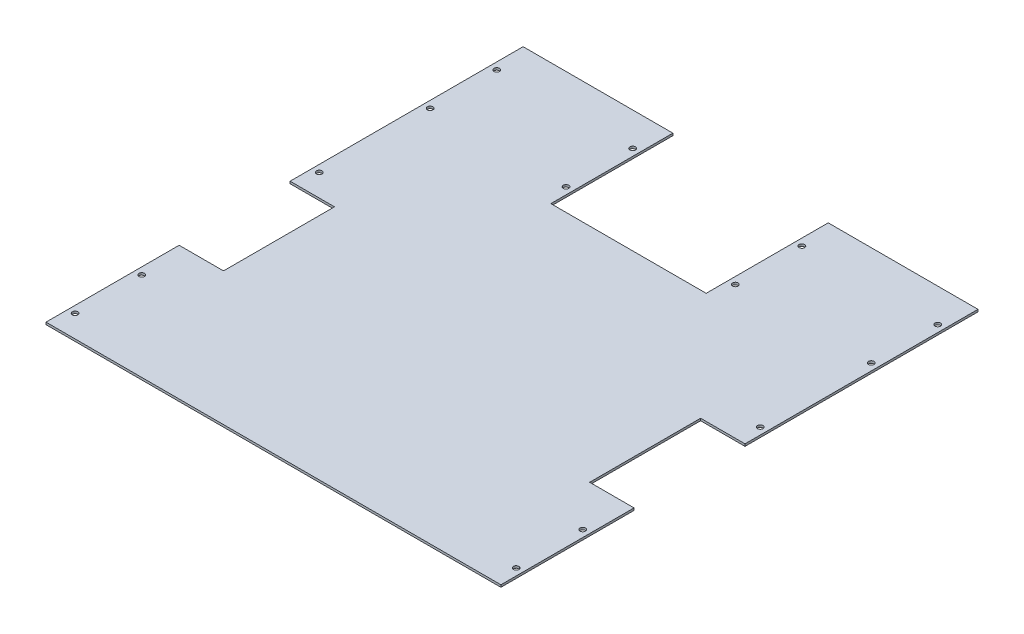
ISO-10303-21;
HEADER;
FILE_DESCRIPTION(('STEP AP214'),'2;1');
FILE_NAME('part.step','',(''),(''),'','','');
FILE_SCHEMA(('AUTOMOTIVE_DESIGN { 1 0 10303 214 1 1 1 1 }'));
ENDSEC;
DATA;
#1=APPLICATION_CONTEXT('core data for automotive mechanical design processes');
#2=APPLICATION_PROTOCOL_DEFINITION('international standard','automotive_design',2000,#1);
#3=PRODUCT_CONTEXT('',#1,'mechanical');
#4=PRODUCT('Part','Part','',(#3));
#5=PRODUCT_RELATED_PRODUCT_CATEGORY('part','',(#4));
#6=PRODUCT_DEFINITION_FORMATION('','',#4);
#7=PRODUCT_DEFINITION_CONTEXT('part definition',#1,'design');
#8=PRODUCT_DEFINITION('design','',#6,#7);
#9=PRODUCT_DEFINITION_SHAPE('','',#8);
#10=(LENGTH_UNIT() NAMED_UNIT(*) SI_UNIT(.MILLI.,.METRE.));
#11=(NAMED_UNIT(*) PLANE_ANGLE_UNIT() SI_UNIT($,.RADIAN.));
#12=(NAMED_UNIT(*) SI_UNIT($,.STERADIAN.) SOLID_ANGLE_UNIT());
#13=UNCERTAINTY_MEASURE_WITH_UNIT(LENGTH_MEASURE(1.E-05),#10,'distance_accuracy_value','');
#14=(GEOMETRIC_REPRESENTATION_CONTEXT(3) GLOBAL_UNCERTAINTY_ASSIGNED_CONTEXT((#13)) GLOBAL_UNIT_ASSIGNED_CONTEXT((#10,
#11,#12)) REPRESENTATION_CONTEXT('',''));
#15=CARTESIAN_POINT('',(0.,0.,0.));
#16=DIRECTION('',(0.,0.,1.));
#17=DIRECTION('',(1.,0.,0.));
#18=AXIS2_PLACEMENT_3D('',#15,#16,#17);
#19=CARTESIAN_POINT('',(0.,2.54,0.));
#20=DIRECTION('',(1.,0.,0.));
#21=DIRECTION('',(0.,0.,-1.));
#22=AXIS2_PLACEMENT_3D('',#19,#20,#21);
#23=PLANE('',#22);
#24=DIRECTION('',(0.,0.,1.));
#25=VECTOR('',#24,1.);
#26=CARTESIAN_POINT('',(0.,0.,0.));
#27=LINE('',#26,#25);
#28=CARTESIAN_POINT('',(0.,0.,-152.4));
#29=VERTEX_POINT('',#28);
#30=CARTESIAN_POINT('',(0.,0.,0.));
#31=VERTEX_POINT('',#30);
#32=EDGE_CURVE('E188',#29,#31,#27,.T.);
#33=ORIENTED_EDGE('',*,*,#32,.T.);
#34=DIRECTION('',(0.,-1.,0.));
#35=VECTOR('',#34,1.);
#36=CARTESIAN_POINT('',(0.,2.54,0.));
#37=LINE('',#36,#35);
#38=CARTESIAN_POINT('',(0.,2.54,0.));
#39=VERTEX_POINT('',#38);
#40=EDGE_CURVE('E11',#39,#31,#37,.T.);
#41=ORIENTED_EDGE('',*,*,#40,.F.);
#42=DIRECTION('',(0.,0.,1.));
#43=VECTOR('',#42,1.);
#44=CARTESIAN_POINT('',(0.,2.54,0.));
#45=LINE('',#44,#43);
#46=CARTESIAN_POINT('',(0.,2.54,-152.4));
#47=VERTEX_POINT('',#46);
#48=EDGE_CURVE('E235',#47,#39,#45,.T.);
#49=ORIENTED_EDGE('',*,*,#48,.F.);
#50=DIRECTION('',(0.,-1.,0.));
#51=VECTOR('',#50,1.);
#52=CARTESIAN_POINT('',(0.,2.54,-152.4));
#53=LINE('',#52,#51);
#54=EDGE_CURVE('E184',#47,#29,#53,.T.);
#55=ORIENTED_EDGE('',*,*,#54,.T.);
#56=EDGE_LOOP('',(#33,#41,#49,#55));
#57=FACE_BOUND('',#56,.T.);
#58=ADVANCED_FACE('F39',(#57),#23,.F.);
#59=CARTESIAN_POINT('',(0.,2.54,0.));
#60=DIRECTION('',(0.,0.,-1.));
#61=DIRECTION('',(-1.,0.,0.));
#62=AXIS2_PLACEMENT_3D('',#59,#60,#61);
#63=PLANE('',#62);
#64=DIRECTION('',(1.,0.,0.));
#65=VECTOR('',#64,1.);
#66=CARTESIAN_POINT('',(0.,0.,0.));
#67=LINE('',#66,#65);
#68=CARTESIAN_POINT('',(520.7,0.,0.));
#69=VERTEX_POINT('',#68);
#70=EDGE_CURVE('E192',#31,#69,#67,.T.);
#71=ORIENTED_EDGE('',*,*,#70,.T.);
#72=DIRECTION('',(0.,-1.,0.));
#73=VECTOR('',#72,1.);
#74=CARTESIAN_POINT('',(520.7,2.54,0.));
#75=LINE('',#74,#73);
#76=CARTESIAN_POINT('',(520.7,2.54,0.));
#77=VERTEX_POINT('',#76);
#78=EDGE_CURVE('E48',#77,#69,#75,.T.);
#79=ORIENTED_EDGE('',*,*,#78,.F.);
#80=DIRECTION('',(1.,0.,0.));
#81=VECTOR('',#80,1.);
#82=CARTESIAN_POINT('',(0.,2.54,0.));
#83=LINE('',#82,#81);
#84=EDGE_CURVE('E123',#39,#77,#83,.T.);
#85=ORIENTED_EDGE('',*,*,#84,.F.);
#86=ORIENTED_EDGE('',*,*,#40,.T.);
#87=EDGE_LOOP('',(#71,#79,#85,#86));
#88=FACE_BOUND('',#87,.T.);
#89=ADVANCED_FACE('F358',(#88),#63,.F.);
#90=CARTESIAN_POINT('',(520.7,2.54,0.));
#91=DIRECTION('',(-1.,0.,0.));
#92=DIRECTION('',(0.,0.,1.));
#93=AXIS2_PLACEMENT_3D('',#90,#91,#92);
#94=PLANE('',#93);
#95=DIRECTION('',(0.,0.,-1.));
#96=VECTOR('',#95,1.);
#97=CARTESIAN_POINT('',(520.7,0.,0.));
#98=LINE('',#97,#96);
#99=CARTESIAN_POINT('',(520.7,0.,-152.4));
#100=VERTEX_POINT('',#99);
#101=EDGE_CURVE('E196',#69,#100,#98,.T.);
#102=ORIENTED_EDGE('',*,*,#101,.T.);
#103=DIRECTION('',(0.,-1.,0.));
#104=VECTOR('',#103,1.);
#105=CARTESIAN_POINT('',(520.7,2.54,-152.4));
#106=LINE('',#105,#104);
#107=CARTESIAN_POINT('',(520.7,2.54,-152.4));
#108=VERTEX_POINT('',#107);
#109=EDGE_CURVE('E278',#108,#100,#106,.T.);
#110=ORIENTED_EDGE('',*,*,#109,.F.);
#111=DIRECTION('',(0.,0.,-1.));
#112=VECTOR('',#111,1.);
#113=CARTESIAN_POINT('',(520.7,2.54,0.));
#114=LINE('',#113,#112);
#115=EDGE_CURVE('E288',#77,#108,#114,.T.);
#116=ORIENTED_EDGE('',*,*,#115,.F.);
#117=ORIENTED_EDGE('',*,*,#78,.T.);
#118=EDGE_LOOP('',(#102,#110,#116,#117));
#119=FACE_BOUND('',#118,.T.);
#120=ADVANCED_FACE('F286',(#119),#94,.F.);
#121=CARTESIAN_POINT('',(520.7,2.54,-152.4));
#122=DIRECTION('',(0.,0.,1.));
#123=DIRECTION('',(1.,0.,0.));
#124=AXIS2_PLACEMENT_3D('',#121,#122,#123);
#125=PLANE('',#124);
#126=DIRECTION('',(-1.,0.,0.));
#127=VECTOR('',#126,1.);
#128=CARTESIAN_POINT('',(520.7,0.,-152.4));
#129=LINE('',#128,#127);
#130=CARTESIAN_POINT('',(469.9,0.,-152.4));
#131=VERTEX_POINT('',#130);
#132=EDGE_CURVE('E199',#100,#131,#129,.T.);
#133=ORIENTED_EDGE('',*,*,#132,.T.);
#134=DIRECTION('',(0.,-1.,0.));
#135=VECTOR('',#134,1.);
#136=CARTESIAN_POINT('',(469.9,2.54,-152.4));
#137=LINE('',#136,#135);
#138=CARTESIAN_POINT('',(469.9,2.54,-152.4));
#139=VERTEX_POINT('',#138);
#140=EDGE_CURVE('E274',#139,#131,#137,.T.);
#141=ORIENTED_EDGE('',*,*,#140,.F.);
#142=DIRECTION('',(-1.,0.,0.));
#143=VECTOR('',#142,1.);
#144=CARTESIAN_POINT('',(520.7,2.54,-152.4));
#145=LINE('',#144,#143);
#146=EDGE_CURVE('E307',#108,#139,#145,.T.);
#147=ORIENTED_EDGE('',*,*,#146,.F.);
#148=ORIENTED_EDGE('',*,*,#109,.T.);
#149=EDGE_LOOP('',(#133,#141,#147,#148));
#150=FACE_BOUND('',#149,.T.);
#151=ADVANCED_FACE('F297',(#150),#125,.F.);
#152=CARTESIAN_POINT('',(469.9,2.54,-152.4));
#153=DIRECTION('',(-1.,0.,0.));
#154=DIRECTION('',(0.,0.,1.));
#155=AXIS2_PLACEMENT_3D('',#152,#153,#154);
#156=PLANE('',#155);
#157=DIRECTION('',(0.,0.,-1.));
#158=VECTOR('',#157,1.);
#159=CARTESIAN_POINT('',(469.9,0.,-152.4));
#160=LINE('',#159,#158);
#161=CARTESIAN_POINT('',(469.9,0.,-279.4));
#162=VERTEX_POINT('',#161);
#163=EDGE_CURVE('E202',#131,#162,#160,.T.);
#164=ORIENTED_EDGE('',*,*,#163,.T.);
#165=DIRECTION('',(0.,-1.,0.));
#166=VECTOR('',#165,1.);
#167=CARTESIAN_POINT('',(469.9,2.54,-279.4));
#168=LINE('',#167,#166);
#169=CARTESIAN_POINT('',(469.9,2.54,-279.4));
#170=VERTEX_POINT('',#169);
#171=EDGE_CURVE('E270',#170,#162,#168,.T.);
#172=ORIENTED_EDGE('',*,*,#171,.F.);
#173=DIRECTION('',(0.,0.,-1.));
#174=VECTOR('',#173,1.);
#175=CARTESIAN_POINT('',(469.9,2.54,-152.4));
#176=LINE('',#175,#174);
#177=EDGE_CURVE('E303',#139,#170,#176,.T.);
#178=ORIENTED_EDGE('',*,*,#177,.F.);
#179=ORIENTED_EDGE('',*,*,#140,.T.);
#180=EDGE_LOOP('',(#164,#172,#178,#179));
#181=FACE_BOUND('',#180,.T.);
#182=ADVANCED_FACE('F301',(#181),#156,.F.);
#183=CARTESIAN_POINT('',(520.7,2.54,-279.4));
#184=DIRECTION('',(0.,0.,-1.));
#185=DIRECTION('',(-1.,0.,0.));
#186=AXIS2_PLACEMENT_3D('',#183,#184,#185);
#187=PLANE('',#186);
#188=DIRECTION('',(1.,0.,0.));
#189=VECTOR('',#188,1.);
#190=CARTESIAN_POINT('',(520.7,0.,-279.4));
#191=LINE('',#190,#189);
#192=CARTESIAN_POINT('',(520.7,0.,-279.4));
#193=VERTEX_POINT('',#192);
#194=EDGE_CURVE('E205',#162,#193,#191,.T.);
#195=ORIENTED_EDGE('',*,*,#194,.T.);
#196=DIRECTION('',(0.,-1.,0.));
#197=VECTOR('',#196,1.);
#198=CARTESIAN_POINT('',(520.7,2.54,-279.4));
#199=LINE('',#198,#197);
#200=CARTESIAN_POINT('',(520.7,2.54,-279.4));
#201=VERTEX_POINT('',#200);
#202=EDGE_CURVE('E266',#201,#193,#199,.T.);
#203=ORIENTED_EDGE('',*,*,#202,.F.);
#204=DIRECTION('',(1.,0.,0.));
#205=VECTOR('',#204,1.);
#206=CARTESIAN_POINT('',(520.7,2.54,-279.4));
#207=LINE('',#206,#205);
#208=EDGE_CURVE('E306',#170,#201,#207,.T.);
#209=ORIENTED_EDGE('',*,*,#208,.F.);
#210=ORIENTED_EDGE('',*,*,#171,.T.);
#211=EDGE_LOOP('',(#195,#203,#209,#210));
#212=FACE_BOUND('',#211,.T.);
#213=ADVANCED_FACE('F371',(#212),#187,.F.);
#214=CARTESIAN_POINT('',(520.7,2.54,-279.4));
#215=DIRECTION('',(-1.,0.,0.));
#216=DIRECTION('',(0.,0.,1.));
#217=AXIS2_PLACEMENT_3D('',#214,#215,#216);
#218=PLANE('',#217);
#219=DIRECTION('',(0.,0.,-1.));
#220=VECTOR('',#219,1.);
#221=CARTESIAN_POINT('',(520.7,0.,-279.4));
#222=LINE('',#221,#220);
#223=CARTESIAN_POINT('',(520.7,0.,-546.1));
#224=VERTEX_POINT('',#223);
#225=EDGE_CURVE('E208',#193,#224,#222,.T.);
#226=ORIENTED_EDGE('',*,*,#225,.T.);
#227=DIRECTION('',(0.,-1.,0.));
#228=VECTOR('',#227,1.);
#229=CARTESIAN_POINT('',(520.7,2.54,-546.1));
#230=LINE('',#229,#228);
#231=CARTESIAN_POINT('',(520.7,2.54,-546.1));
#232=VERTEX_POINT('',#231);
#233=EDGE_CURVE('E262',#232,#224,#230,.T.);
#234=ORIENTED_EDGE('',*,*,#233,.F.);
#235=DIRECTION('',(0.,0.,-1.));
#236=VECTOR('',#235,1.);
#237=CARTESIAN_POINT('',(520.7,2.54,-279.4));
#238=LINE('',#237,#236);
#239=EDGE_CURVE('E311',#201,#232,#238,.T.);
#240=ORIENTED_EDGE('',*,*,#239,.F.);
#241=ORIENTED_EDGE('',*,*,#202,.T.);
#242=EDGE_LOOP('',(#226,#234,#240,#241));
#243=FACE_BOUND('',#242,.T.);
#244=ADVANCED_FACE('F374',(#243),#218,.F.);
#245=CARTESIAN_POINT('',(349.25,2.54,-546.1));
#246=DIRECTION('',(0.,0.,1.));
#247=DIRECTION('',(1.,0.,0.));
#248=AXIS2_PLACEMENT_3D('',#245,#246,#247);
#249=PLANE('',#248);
#250=DIRECTION('',(-1.,0.,0.));
#251=VECTOR('',#250,1.);
#252=CARTESIAN_POINT('',(349.25,0.,-546.1));
#253=LINE('',#252,#251);
#254=CARTESIAN_POINT('',(349.25,0.,-546.1));
#255=VERTEX_POINT('',#254);
#256=EDGE_CURVE('E211',#224,#255,#253,.T.);
#257=ORIENTED_EDGE('',*,*,#256,.T.);
#258=DIRECTION('',(0.,-1.,0.));
#259=VECTOR('',#258,1.);
#260=CARTESIAN_POINT('',(349.25,2.54,-546.1));
#261=LINE('',#260,#259);
#262=CARTESIAN_POINT('',(349.25,2.54,-546.1));
#263=VERTEX_POINT('',#262);
#264=EDGE_CURVE('E258',#263,#255,#261,.T.);
#265=ORIENTED_EDGE('',*,*,#264,.F.);
#266=DIRECTION('',(-1.,0.,0.));
#267=VECTOR('',#266,1.);
#268=CARTESIAN_POINT('',(349.25,2.54,-546.1));
#269=LINE('',#268,#267);
#270=EDGE_CURVE('E318',#232,#263,#269,.T.);
#271=ORIENTED_EDGE('',*,*,#270,.F.);
#272=ORIENTED_EDGE('',*,*,#233,.T.);
#273=EDGE_LOOP('',(#257,#265,#271,#272));
#274=FACE_BOUND('',#273,.T.);
#275=ADVANCED_FACE('F378',(#274),#249,.F.);
#276=CARTESIAN_POINT('',(349.25,2.54,-546.1));
#277=DIRECTION('',(1.,0.,0.));
#278=DIRECTION('',(0.,0.,-1.));
#279=AXIS2_PLACEMENT_3D('',#276,#277,#278);
#280=PLANE('',#279);
#281=DIRECTION('',(0.,0.,1.));
#282=VECTOR('',#281,1.);
#283=CARTESIAN_POINT('',(349.25,0.,-546.1));
#284=LINE('',#283,#282);
#285=CARTESIAN_POINT('',(349.25,0.,-406.4));
#286=VERTEX_POINT('',#285);
#287=EDGE_CURVE('E214',#255,#286,#284,.T.);
#288=ORIENTED_EDGE('',*,*,#287,.T.);
#289=DIRECTION('',(0.,-1.,0.));
#290=VECTOR('',#289,1.);
#291=CARTESIAN_POINT('',(349.25,2.54,-406.4));
#292=LINE('',#291,#290);
#293=CARTESIAN_POINT('',(349.25,2.54,-406.4));
#294=VERTEX_POINT('',#293);
#295=EDGE_CURVE('E254',#294,#286,#292,.T.);
#296=ORIENTED_EDGE('',*,*,#295,.F.);
#297=DIRECTION('',(0.,0.,1.));
#298=VECTOR('',#297,1.);
#299=CARTESIAN_POINT('',(349.25,2.54,-546.1));
#300=LINE('',#299,#298);
#301=EDGE_CURVE('E321',#263,#294,#300,.T.);
#302=ORIENTED_EDGE('',*,*,#301,.F.);
#303=ORIENTED_EDGE('',*,*,#264,.T.);
#304=EDGE_LOOP('',(#288,#296,#302,#303));
#305=FACE_BOUND('',#304,.T.);
#306=ADVANCED_FACE('F382',(#305),#280,.F.);
#307=CARTESIAN_POINT('',(171.45,2.54,-406.4));
#308=DIRECTION('',(0.,0.,1.));
#309=DIRECTION('',(1.,0.,0.));
#310=AXIS2_PLACEMENT_3D('',#307,#308,#309);
#311=PLANE('',#310);
#312=DIRECTION('',(-1.,0.,0.));
#313=VECTOR('',#312,1.);
#314=CARTESIAN_POINT('',(171.45,0.,-406.4));
#315=LINE('',#314,#313);
#316=CARTESIAN_POINT('',(171.45,0.,-406.4));
#317=VERTEX_POINT('',#316);
#318=EDGE_CURVE('E217',#286,#317,#315,.T.);
#319=ORIENTED_EDGE('',*,*,#318,.T.);
#320=DIRECTION('',(0.,-1.,0.));
#321=VECTOR('',#320,1.);
#322=CARTESIAN_POINT('',(171.45,2.54,-406.4));
#323=LINE('',#322,#321);
#324=CARTESIAN_POINT('',(171.45,2.54,-406.4));
#325=VERTEX_POINT('',#324);
#326=EDGE_CURVE('E250',#325,#317,#323,.T.);
#327=ORIENTED_EDGE('',*,*,#326,.F.);
#328=DIRECTION('',(-1.,0.,0.));
#329=VECTOR('',#328,1.);
#330=CARTESIAN_POINT('',(171.45,2.54,-406.4));
#331=LINE('',#330,#329);
#332=EDGE_CURVE('E324',#294,#325,#331,.T.);
#333=ORIENTED_EDGE('',*,*,#332,.F.);
#334=ORIENTED_EDGE('',*,*,#295,.T.);
#335=EDGE_LOOP('',(#319,#327,#333,#334));
#336=FACE_BOUND('',#335,.T.);
#337=ADVANCED_FACE('F386',(#336),#311,.F.);
#338=CARTESIAN_POINT('',(171.45,2.54,-546.1));
#339=DIRECTION('',(-1.,0.,0.));
#340=DIRECTION('',(0.,0.,1.));
#341=AXIS2_PLACEMENT_3D('',#338,#339,#340);
#342=PLANE('',#341);
#343=DIRECTION('',(0.,0.,-1.));
#344=VECTOR('',#343,1.);
#345=CARTESIAN_POINT('',(171.45,0.,-546.1));
#346=LINE('',#345,#344);
#347=CARTESIAN_POINT('',(171.45,0.,-546.1));
#348=VERTEX_POINT('',#347);
#349=EDGE_CURVE('E220',#317,#348,#346,.T.);
#350=ORIENTED_EDGE('',*,*,#349,.T.);
#351=DIRECTION('',(0.,-1.,0.));
#352=VECTOR('',#351,1.);
#353=CARTESIAN_POINT('',(171.45,2.54,-546.1));
#354=LINE('',#353,#352);
#355=CARTESIAN_POINT('',(171.45,2.54,-546.1));
#356=VERTEX_POINT('',#355);
#357=EDGE_CURVE('E246',#356,#348,#354,.T.);
#358=ORIENTED_EDGE('',*,*,#357,.F.);
#359=DIRECTION('',(0.,0.,-1.));
#360=VECTOR('',#359,1.);
#361=CARTESIAN_POINT('',(171.45,2.54,-546.1));
#362=LINE('',#361,#360);
#363=EDGE_CURVE('E327',#325,#356,#362,.T.);
#364=ORIENTED_EDGE('',*,*,#363,.F.);
#365=ORIENTED_EDGE('',*,*,#326,.T.);
#366=EDGE_LOOP('',(#350,#358,#364,#365));
#367=FACE_BOUND('',#366,.T.);
#368=ADVANCED_FACE('F390',(#367),#342,.F.);
#369=CARTESIAN_POINT('',(0.,2.54,-546.1));
#370=DIRECTION('',(0.,0.,1.));
#371=DIRECTION('',(1.,0.,0.));
#372=AXIS2_PLACEMENT_3D('',#369,#370,#371);
#373=PLANE('',#372);
#374=DIRECTION('',(-1.,0.,0.));
#375=VECTOR('',#374,1.);
#376=CARTESIAN_POINT('',(0.,0.,-546.1));
#377=LINE('',#376,#375);
#378=CARTESIAN_POINT('',(0.,0.,-546.1));
#379=VERTEX_POINT('',#378);
#380=EDGE_CURVE('E223',#348,#379,#377,.T.);
#381=ORIENTED_EDGE('',*,*,#380,.T.);
#382=DIRECTION('',(0.,-1.,0.));
#383=VECTOR('',#382,1.);
#384=CARTESIAN_POINT('',(0.,2.54,-546.1));
#385=LINE('',#384,#383);
#386=CARTESIAN_POINT('',(0.,2.54,-546.1));
#387=VERTEX_POINT('',#386);
#388=EDGE_CURVE('E242',#387,#379,#385,.T.);
#389=ORIENTED_EDGE('',*,*,#388,.F.);
#390=DIRECTION('',(-1.,0.,0.));
#391=VECTOR('',#390,1.);
#392=CARTESIAN_POINT('',(0.,2.54,-546.1));
#393=LINE('',#392,#391);
#394=EDGE_CURVE('E330',#356,#387,#393,.T.);
#395=ORIENTED_EDGE('',*,*,#394,.F.);
#396=ORIENTED_EDGE('',*,*,#357,.T.);
#397=EDGE_LOOP('',(#381,#389,#395,#396));
#398=FACE_BOUND('',#397,.T.);
#399=ADVANCED_FACE('F338',(#398),#373,.F.);
#400=CARTESIAN_POINT('',(0.,2.54,-279.4));
#401=DIRECTION('',(1.,0.,0.));
#402=DIRECTION('',(0.,0.,-1.));
#403=AXIS2_PLACEMENT_3D('',#400,#401,#402);
#404=PLANE('',#403);
#405=DIRECTION('',(0.,0.,1.));
#406=VECTOR('',#405,1.);
#407=CARTESIAN_POINT('',(0.,0.,-279.4));
#408=LINE('',#407,#406);
#409=CARTESIAN_POINT('',(0.,0.,-279.4));
#410=VERTEX_POINT('',#409);
#411=EDGE_CURVE('E226',#379,#410,#408,.T.);
#412=ORIENTED_EDGE('',*,*,#411,.T.);
#413=DIRECTION('',(0.,-1.,0.));
#414=VECTOR('',#413,1.);
#415=CARTESIAN_POINT('',(0.,2.54,-279.4));
#416=LINE('',#415,#414);
#417=CARTESIAN_POINT('',(0.,2.54,-279.4));
#418=VERTEX_POINT('',#417);
#419=EDGE_CURVE('E177',#418,#410,#416,.T.);
#420=ORIENTED_EDGE('',*,*,#419,.F.);
#421=DIRECTION('',(0.,0.,1.));
#422=VECTOR('',#421,1.);
#423=CARTESIAN_POINT('',(0.,2.54,-279.4));
#424=LINE('',#423,#422);
#425=EDGE_CURVE('E166',#387,#418,#424,.T.);
#426=ORIENTED_EDGE('',*,*,#425,.F.);
#427=ORIENTED_EDGE('',*,*,#388,.T.);
#428=EDGE_LOOP('',(#412,#420,#426,#427));
#429=FACE_BOUND('',#428,.T.);
#430=ADVANCED_FACE('F342',(#429),#404,.F.);
#431=CARTESIAN_POINT('',(0.,2.54,-279.4));
#432=DIRECTION('',(0.,0.,-1.));
#433=DIRECTION('',(-1.,0.,0.));
#434=AXIS2_PLACEMENT_3D('',#431,#432,#433);
#435=PLANE('',#434);
#436=DIRECTION('',(1.,0.,0.));
#437=VECTOR('',#436,1.);
#438=CARTESIAN_POINT('',(0.,0.,-279.4));
#439=LINE('',#438,#437);
#440=CARTESIAN_POINT('',(50.7999999999999,0.,-279.4));
#441=VERTEX_POINT('',#440);
#442=EDGE_CURVE('E175',#410,#441,#439,.T.);
#443=ORIENTED_EDGE('',*,*,#442,.T.);
#444=DIRECTION('',(0.,-1.,0.));
#445=VECTOR('',#444,1.);
#446=CARTESIAN_POINT('',(50.7999999999999,2.54,-279.4));
#447=LINE('',#446,#445);
#448=CARTESIAN_POINT('',(50.7999999999999,2.54,-279.4));
#449=VERTEX_POINT('',#448);
#450=EDGE_CURVE('E172',#449,#441,#447,.T.);
#451=ORIENTED_EDGE('',*,*,#450,.F.);
#452=DIRECTION('',(1.,0.,0.));
#453=VECTOR('',#452,1.);
#454=CARTESIAN_POINT('',(0.,2.54,-279.4));
#455=LINE('',#454,#453);
#456=EDGE_CURVE('E160',#418,#449,#455,.T.);
#457=ORIENTED_EDGE('',*,*,#456,.F.);
#458=ORIENTED_EDGE('',*,*,#419,.T.);
#459=EDGE_LOOP('',(#443,#451,#457,#458));
#460=FACE_BOUND('',#459,.T.);
#461=ADVANCED_FACE('F173',(#460),#435,.F.);
#462=CARTESIAN_POINT('',(50.8,2.54,-152.4));
#463=DIRECTION('',(1.,0.,0.));
#464=DIRECTION('',(0.,0.,-1.));
#465=AXIS2_PLACEMENT_3D('',#462,#463,#464);
#466=PLANE('',#465);
#467=DIRECTION('',(0.,0.,1.));
#468=VECTOR('',#467,1.);
#469=CARTESIAN_POINT('',(50.8,0.,-152.4));
#470=LINE('',#469,#468);
#471=CARTESIAN_POINT('',(50.8,0.,-152.4));
#472=VERTEX_POINT('',#471);
#473=EDGE_CURVE('E109',#441,#472,#470,.T.);
#474=ORIENTED_EDGE('',*,*,#473,.T.);
#475=DIRECTION('',(0.,-1.,0.));
#476=VECTOR('',#475,1.);
#477=CARTESIAN_POINT('',(50.8,2.54,-152.4));
#478=LINE('',#477,#476);
#479=CARTESIAN_POINT('',(50.8,2.54,-152.4));
#480=VERTEX_POINT('',#479);
#481=EDGE_CURVE('E178',#480,#472,#478,.T.);
#482=ORIENTED_EDGE('',*,*,#481,.F.);
#483=DIRECTION('',(0.,0.,1.));
#484=VECTOR('',#483,1.);
#485=CARTESIAN_POINT('',(50.8,2.54,-152.4));
#486=LINE('',#485,#484);
#487=EDGE_CURVE('E164',#449,#480,#486,.T.);
#488=ORIENTED_EDGE('',*,*,#487,.F.);
#489=ORIENTED_EDGE('',*,*,#450,.T.);
#490=EDGE_LOOP('',(#474,#482,#488,#489));
#491=FACE_BOUND('',#490,.T.);
#492=ADVANCED_FACE('F180',(#491),#466,.F.);
#493=CARTESIAN_POINT('',(0.,2.54,-152.4));
#494=DIRECTION('',(0.,0.,1.));
#495=DIRECTION('',(1.,0.,0.));
#496=AXIS2_PLACEMENT_3D('',#493,#494,#495);
#497=PLANE('',#496);
#498=DIRECTION('',(-1.,0.,0.));
#499=VECTOR('',#498,1.);
#500=CARTESIAN_POINT('',(0.,0.,-152.4));
#501=LINE('',#500,#499);
#502=EDGE_CURVE('E115',#472,#29,#501,.T.);
#503=ORIENTED_EDGE('',*,*,#502,.T.);
#504=ORIENTED_EDGE('',*,*,#54,.F.);
#505=DIRECTION('',(-1.,0.,0.));
#506=VECTOR('',#505,1.);
#507=CARTESIAN_POINT('',(0.,2.54,-152.4));
#508=LINE('',#507,#506);
#509=EDGE_CURVE('E56',#480,#47,#508,.T.);
#510=ORIENTED_EDGE('',*,*,#509,.F.);
#511=ORIENTED_EDGE('',*,*,#481,.T.);
#512=EDGE_LOOP('',(#503,#504,#510,#511));
#513=FACE_BOUND('',#512,.T.);
#514=ADVANCED_FACE('F346',(#513),#497,.F.);
#515=CARTESIAN_POINT('',(0.,2.54,0.));
#516=DIRECTION('',(0.,-1.,0.));
#517=DIRECTION('',(0.,0.,-1.));
#518=AXIS2_PLACEMENT_3D('',#515,#516,#517);
#519=PLANE('',#518);
#520=CARTESIAN_POINT('',(163.5125,2.54,-431.8));
#521=DIRECTION('',(0.,1.,0.));
#522=DIRECTION('',(0.,0.,1.));
#523=AXIS2_PLACEMENT_3D('',#520,#521,#522);
#524=CIRCLE('',#523,3.17499999999997);
#525=CARTESIAN_POINT('',(163.5125,2.54,-428.625));
#526=VERTEX_POINT('',#525);
#527=EDGE_CURVE('E576',#526,#526,#524,.T.);
#528=ORIENTED_EDGE('',*,*,#527,.F.);
#529=EDGE_LOOP('',(#528));
#530=FACE_BOUND('',#529,.T.);
#531=CARTESIAN_POINT('',(7.9375,2.54,-431.8));
#532=DIRECTION('',(0.,1.,0.));
#533=DIRECTION('',(0.,0.,1.));
#534=AXIS2_PLACEMENT_3D('',#531,#532,#533);
#535=CIRCLE('',#534,3.175);
#536=CARTESIAN_POINT('',(7.9375,2.54,-428.625));
#537=VERTEX_POINT('',#536);
#538=EDGE_CURVE('E582',#537,#537,#535,.T.);
#539=ORIENTED_EDGE('',*,*,#538,.F.);
#540=EDGE_LOOP('',(#539));
#541=FACE_BOUND('',#540,.T.);
#542=CARTESIAN_POINT('',(7.9375,2.54,-304.8));
#543=DIRECTION('',(0.,1.,0.));
#544=DIRECTION('',(0.,0.,1.));
#545=AXIS2_PLACEMENT_3D('',#542,#543,#544);
#546=CIRCLE('',#545,3.175);
#547=CARTESIAN_POINT('',(7.9375,2.54,-301.625));
#548=VERTEX_POINT('',#547);
#549=EDGE_CURVE('E602',#548,#548,#546,.T.);
#550=ORIENTED_EDGE('',*,*,#549,.F.);
#551=EDGE_LOOP('',(#550));
#552=FACE_BOUND('',#551,.T.);
#553=CARTESIAN_POINT('',(163.5125,2.54,-508.));
#554=DIRECTION('',(0.,1.,0.));
#555=DIRECTION('',(0.,0.,1.));
#556=AXIS2_PLACEMENT_3D('',#553,#554,#555);
#557=CIRCLE('',#556,3.17499999999997);
#558=CARTESIAN_POINT('',(163.5125,2.54,-504.825));
#559=VERTEX_POINT('',#558);
#560=EDGE_CURVE('E594',#559,#559,#557,.T.);
#561=ORIENTED_EDGE('',*,*,#560,.F.);
#562=EDGE_LOOP('',(#561));
#563=FACE_BOUND('',#562,.T.);
#564=CARTESIAN_POINT('',(7.9375,2.54,-101.6));
#565=DIRECTION('',(0.,1.,0.));
#566=DIRECTION('',(0.,0.,1.));
#567=AXIS2_PLACEMENT_3D('',#564,#565,#566);
#568=CIRCLE('',#567,3.175);
#569=CARTESIAN_POINT('',(7.9375,2.54,-98.425));
#570=VERTEX_POINT('',#569);
#571=EDGE_CURVE('E585',#570,#570,#568,.T.);
#572=ORIENTED_EDGE('',*,*,#571,.F.);
#573=EDGE_LOOP('',(#572));
#574=FACE_BOUND('',#573,.T.);
#575=CARTESIAN_POINT('',(7.9375,2.54,-25.4));
#576=DIRECTION('',(0.,1.,0.));
#577=DIRECTION('',(0.,0.,1.));
#578=AXIS2_PLACEMENT_3D('',#575,#576,#577);
#579=CIRCLE('',#578,3.175);
#580=CARTESIAN_POINT('',(7.9375,2.54,-22.225));
#581=VERTEX_POINT('',#580);
#582=EDGE_CURVE('E614',#581,#581,#579,.T.);
#583=ORIENTED_EDGE('',*,*,#582,.F.);
#584=EDGE_LOOP('',(#583));
#585=FACE_BOUND('',#584,.T.);
#586=CARTESIAN_POINT('',(512.7625,2.54,-25.4000000000001));
#587=DIRECTION('',(0.,1.,0.));
#588=DIRECTION('',(0.,0.,-1.));
#589=AXIS2_PLACEMENT_3D('',#586,#587,#588);
#590=CIRCLE('',#589,3.17500000000008);
#591=CARTESIAN_POINT('',(512.7625,2.54,-28.5750000000001));
#592=VERTEX_POINT('',#591);
#593=EDGE_CURVE('E622',#592,#592,#590,.T.);
#594=ORIENTED_EDGE('',*,*,#593,.F.);
#595=EDGE_LOOP('',(#594));
#596=FACE_BOUND('',#595,.T.);
#597=CARTESIAN_POINT('',(512.7625,2.54,-101.6));
#598=DIRECTION('',(0.,1.,0.));
#599=DIRECTION('',(0.,0.,-1.));
#600=AXIS2_PLACEMENT_3D('',#597,#598,#599);
#601=CIRCLE('',#600,3.17500000000008);
#602=CARTESIAN_POINT('',(512.7625,2.54,-104.775));
#603=VERTEX_POINT('',#602);
#604=EDGE_CURVE('E630',#603,#603,#601,.T.);
#605=ORIENTED_EDGE('',*,*,#604,.F.);
#606=EDGE_LOOP('',(#605));
#607=FACE_BOUND('',#606,.T.);
#608=CARTESIAN_POINT('',(512.7625,2.54,-508.));
#609=DIRECTION('',(0.,1.,0.));
#610=DIRECTION('',(0.,0.,-1.));
#611=AXIS2_PLACEMENT_3D('',#608,#609,#610);
#612=CIRCLE('',#611,3.17500000000008);
#613=CARTESIAN_POINT('',(512.7625,2.54,-511.175));
#614=VERTEX_POINT('',#613);
#615=EDGE_CURVE('E685',#614,#614,#612,.T.);
#616=ORIENTED_EDGE('',*,*,#615,.F.);
#617=EDGE_LOOP('',(#616));
#618=FACE_BOUND('',#617,.T.);
#619=CARTESIAN_POINT('',(512.7625,2.54,-304.8));
#620=DIRECTION('',(0.,1.,0.));
#621=DIRECTION('',(0.,0.,-1.));
#622=AXIS2_PLACEMENT_3D('',#619,#620,#621);
#623=CIRCLE('',#622,3.17500000000008);
#624=CARTESIAN_POINT('',(512.7625,2.54,-307.975));
#625=VERTEX_POINT('',#624);
#626=EDGE_CURVE('E662',#625,#625,#623,.T.);
#627=ORIENTED_EDGE('',*,*,#626,.F.);
#628=EDGE_LOOP('',(#627));
#629=FACE_BOUND('',#628,.T.);
#630=CARTESIAN_POINT('',(357.1875,2.54,-431.8));
#631=DIRECTION('',(0.,1.,0.));
#632=DIRECTION('',(0.,0.,-1.));
#633=AXIS2_PLACEMENT_3D('',#630,#631,#632);
#634=CIRCLE('',#633,3.17499999999992);
#635=CARTESIAN_POINT('',(357.1875,2.54,-434.975));
#636=VERTEX_POINT('',#635);
#637=EDGE_CURVE('E653',#636,#636,#634,.T.);
#638=ORIENTED_EDGE('',*,*,#637,.F.);
#639=EDGE_LOOP('',(#638));
#640=FACE_BOUND('',#639,.T.);
#641=CARTESIAN_POINT('',(512.7625,2.54,-431.8));
#642=DIRECTION('',(0.,1.,0.));
#643=DIRECTION('',(0.,0.,-1.));
#644=AXIS2_PLACEMENT_3D('',#641,#642,#643);
#645=CIRCLE('',#644,3.17500000000008);
#646=CARTESIAN_POINT('',(512.7625,2.54,-434.975));
#647=VERTEX_POINT('',#646);
#648=EDGE_CURVE('E678',#647,#647,#645,.T.);
#649=ORIENTED_EDGE('',*,*,#648,.F.);
#650=EDGE_LOOP('',(#649));
#651=FACE_BOUND('',#650,.T.);
#652=CARTESIAN_POINT('',(357.1875,2.54,-508.));
#653=DIRECTION('',(0.,1.,0.));
#654=DIRECTION('',(0.,0.,-1.));
#655=AXIS2_PLACEMENT_3D('',#652,#653,#654);
#656=CIRCLE('',#655,3.175);
#657=CARTESIAN_POINT('',(357.1875,2.54,-511.175));
#658=VERTEX_POINT('',#657);
#659=EDGE_CURVE('E669',#658,#658,#656,.T.);
#660=ORIENTED_EDGE('',*,*,#659,.F.);
#661=EDGE_LOOP('',(#660));
#662=FACE_BOUND('',#661,.T.);
#663=CARTESIAN_POINT('',(7.9375,2.54,-508.));
#664=DIRECTION('',(0.,1.,0.));
#665=DIRECTION('',(0.,0.,1.));
#666=AXIS2_PLACEMENT_3D('',#663,#664,#665);
#667=CIRCLE('',#666,3.175);
#668=CARTESIAN_POINT('',(7.9375,2.54,-504.825));
#669=VERTEX_POINT('',#668);
#670=EDGE_CURVE('E593',#669,#669,#667,.T.);
#671=ORIENTED_EDGE('',*,*,#670,.F.);
#672=EDGE_LOOP('',(#671));
#673=FACE_BOUND('',#672,.T.);
#674=ORIENTED_EDGE('',*,*,#48,.T.);
#675=ORIENTED_EDGE('',*,*,#84,.T.);
#676=ORIENTED_EDGE('',*,*,#115,.T.);
#677=ORIENTED_EDGE('',*,*,#146,.T.);
#678=ORIENTED_EDGE('',*,*,#177,.T.);
#679=ORIENTED_EDGE('',*,*,#208,.T.);
#680=ORIENTED_EDGE('',*,*,#239,.T.);
#681=ORIENTED_EDGE('',*,*,#270,.T.);
#682=ORIENTED_EDGE('',*,*,#301,.T.);
#683=ORIENTED_EDGE('',*,*,#332,.T.);
#684=ORIENTED_EDGE('',*,*,#363,.T.);
#685=ORIENTED_EDGE('',*,*,#394,.T.);
#686=ORIENTED_EDGE('',*,*,#425,.T.);
#687=ORIENTED_EDGE('',*,*,#456,.T.);
#688=ORIENTED_EDGE('',*,*,#487,.T.);
#689=ORIENTED_EDGE('',*,*,#509,.T.);
#690=EDGE_LOOP('',(#674,#675,#676,#677,#678,#679,#680,#681,#682,#683,#684,#685,#686,#687,#688,#689));
#691=FACE_BOUND('',#690,.T.);
#692=ADVANCED_FACE('F162',(#530,#541,#552,#563,#574,#585,#596,#607,#618,#629,#640,#651,#662,
#673,#691),#519,.F.);
#693=CARTESIAN_POINT('',(0.,0.,0.));
#694=DIRECTION('',(0.,-1.,0.));
#695=DIRECTION('',(0.,0.,-1.));
#696=AXIS2_PLACEMENT_3D('',#693,#694,#695);
#697=PLANE('',#696);
#698=CARTESIAN_POINT('',(163.5125,0.,-431.8));
#699=DIRECTION('',(0.,1.,0.));
#700=DIRECTION('',(0.,0.,1.));
#701=AXIS2_PLACEMENT_3D('',#698,#699,#700);
#702=CIRCLE('',#701,3.17499999999997);
#703=CARTESIAN_POINT('',(163.5125,0.,-428.625));
#704=VERTEX_POINT('',#703);
#705=EDGE_CURVE('E573',#704,#704,#702,.T.);
#706=ORIENTED_EDGE('',*,*,#705,.T.);
#707=EDGE_LOOP('',(#706));
#708=FACE_BOUND('',#707,.T.);
#709=CARTESIAN_POINT('',(7.9375,0.,-431.8));
#710=DIRECTION('',(0.,1.,0.));
#711=DIRECTION('',(0.,0.,1.));
#712=AXIS2_PLACEMENT_3D('',#709,#710,#711);
#713=CIRCLE('',#712,3.175);
#714=CARTESIAN_POINT('',(7.9375,0.,-428.625));
#715=VERTEX_POINT('',#714);
#716=EDGE_CURVE('E605',#715,#715,#713,.T.);
#717=ORIENTED_EDGE('',*,*,#716,.T.);
#718=EDGE_LOOP('',(#717));
#719=FACE_BOUND('',#718,.T.);
#720=CARTESIAN_POINT('',(7.9375,0.,-304.8));
#721=DIRECTION('',(0.,1.,0.));
#722=DIRECTION('',(0.,0.,1.));
#723=AXIS2_PLACEMENT_3D('',#720,#721,#722);
#724=CIRCLE('',#723,3.175);
#725=CARTESIAN_POINT('',(7.9375,0.,-301.625));
#726=VERTEX_POINT('',#725);
#727=EDGE_CURVE('E598',#726,#726,#724,.T.);
#728=ORIENTED_EDGE('',*,*,#727,.T.);
#729=EDGE_LOOP('',(#728));
#730=FACE_BOUND('',#729,.T.);
#731=CARTESIAN_POINT('',(163.5125,0.,-508.));
#732=DIRECTION('',(0.,1.,0.));
#733=DIRECTION('',(0.,0.,1.));
#734=AXIS2_PLACEMENT_3D('',#731,#732,#733);
#735=CIRCLE('',#734,3.17499999999997);
#736=CARTESIAN_POINT('',(163.5125,0.,-504.825));
#737=VERTEX_POINT('',#736);
#738=EDGE_CURVE('E589',#737,#737,#735,.T.);
#739=ORIENTED_EDGE('',*,*,#738,.T.);
#740=EDGE_LOOP('',(#739));
#741=FACE_BOUND('',#740,.T.);
#742=CARTESIAN_POINT('',(7.9375,0.,-101.6));
#743=DIRECTION('',(0.,1.,0.));
#744=DIRECTION('',(0.,0.,1.));
#745=AXIS2_PLACEMENT_3D('',#742,#743,#744);
#746=CIRCLE('',#745,3.175);
#747=CARTESIAN_POINT('',(7.9375,0.,-98.425));
#748=VERTEX_POINT('',#747);
#749=EDGE_CURVE('E578',#748,#748,#746,.T.);
#750=ORIENTED_EDGE('',*,*,#749,.T.);
#751=EDGE_LOOP('',(#750));
#752=FACE_BOUND('',#751,.T.);
#753=CARTESIAN_POINT('',(7.9375,0.,-25.4));
#754=DIRECTION('',(0.,1.,0.));
#755=DIRECTION('',(0.,0.,1.));
#756=AXIS2_PLACEMENT_3D('',#753,#754,#755);
#757=CIRCLE('',#756,3.175);
#758=CARTESIAN_POINT('',(7.9375,0.,-22.225));
#759=VERTEX_POINT('',#758);
#760=EDGE_CURVE('E610',#759,#759,#757,.T.);
#761=ORIENTED_EDGE('',*,*,#760,.T.);
#762=EDGE_LOOP('',(#761));
#763=FACE_BOUND('',#762,.T.);
#764=CARTESIAN_POINT('',(512.7625,0.,-25.4000000000001));
#765=DIRECTION('',(0.,1.,0.));
#766=DIRECTION('',(0.,0.,-1.));
#767=AXIS2_PLACEMENT_3D('',#764,#765,#766);
#768=CIRCLE('',#767,3.17500000000008);
#769=CARTESIAN_POINT('',(512.7625,0.,-28.5750000000001));
#770=VERTEX_POINT('',#769);
#771=EDGE_CURVE('E618',#770,#770,#768,.T.);
#772=ORIENTED_EDGE('',*,*,#771,.T.);
#773=EDGE_LOOP('',(#772));
#774=FACE_BOUND('',#773,.T.);
#775=CARTESIAN_POINT('',(512.7625,0.,-101.6));
#776=DIRECTION('',(0.,1.,0.));
#777=DIRECTION('',(0.,0.,-1.));
#778=AXIS2_PLACEMENT_3D('',#775,#776,#777);
#779=CIRCLE('',#778,3.17500000000008);
#780=CARTESIAN_POINT('',(512.7625,0.,-104.775));
#781=VERTEX_POINT('',#780);
#782=EDGE_CURVE('E626',#781,#781,#779,.T.);
#783=ORIENTED_EDGE('',*,*,#782,.T.);
#784=EDGE_LOOP('',(#783));
#785=FACE_BOUND('',#784,.T.);
#786=CARTESIAN_POINT('',(512.7625,0.,-508.));
#787=DIRECTION('',(0.,1.,0.));
#788=DIRECTION('',(0.,0.,-1.));
#789=AXIS2_PLACEMENT_3D('',#786,#787,#788);
#790=CIRCLE('',#789,3.17500000000008);
#791=CARTESIAN_POINT('',(512.7625,0.,-511.175));
#792=VERTEX_POINT('',#791);
#793=EDGE_CURVE('E674',#792,#792,#790,.T.);
#794=ORIENTED_EDGE('',*,*,#793,.T.);
#795=EDGE_LOOP('',(#794));
#796=FACE_BOUND('',#795,.T.);
#797=CARTESIAN_POINT('',(512.7625,0.,-304.8));
#798=DIRECTION('',(0.,1.,0.));
#799=DIRECTION('',(0.,0.,-1.));
#800=AXIS2_PLACEMENT_3D('',#797,#798,#799);
#801=CIRCLE('',#800,3.17500000000008);
#802=CARTESIAN_POINT('',(512.7625,0.,-307.975));
#803=VERTEX_POINT('',#802);
#804=EDGE_CURVE('E634',#803,#803,#801,.T.);
#805=ORIENTED_EDGE('',*,*,#804,.T.);
#806=EDGE_LOOP('',(#805));
#807=FACE_BOUND('',#806,.T.);
#808=CARTESIAN_POINT('',(357.1875,0.,-431.8));
#809=DIRECTION('',(0.,1.,0.));
#810=DIRECTION('',(0.,0.,-1.));
#811=AXIS2_PLACEMENT_3D('',#808,#809,#810);
#812=CIRCLE('',#811,3.17499999999992);
#813=CARTESIAN_POINT('',(357.1875,0.,-434.975));
#814=VERTEX_POINT('',#813);
#815=EDGE_CURVE('E657',#814,#814,#812,.T.);
#816=ORIENTED_EDGE('',*,*,#815,.T.);
#817=EDGE_LOOP('',(#816));
#818=FACE_BOUND('',#817,.T.);
#819=CARTESIAN_POINT('',(512.7625,0.,-431.8));
#820=DIRECTION('',(0.,1.,0.));
#821=DIRECTION('',(0.,0.,-1.));
#822=AXIS2_PLACEMENT_3D('',#819,#820,#821);
#823=CIRCLE('',#822,3.17500000000008);
#824=CARTESIAN_POINT('',(512.7625,0.,-434.975));
#825=VERTEX_POINT('',#824);
#826=EDGE_CURVE('E658',#825,#825,#823,.T.);
#827=ORIENTED_EDGE('',*,*,#826,.T.);
#828=EDGE_LOOP('',(#827));
#829=FACE_BOUND('',#828,.T.);
#830=CARTESIAN_POINT('',(357.1875,0.,-508.));
#831=DIRECTION('',(0.,1.,0.));
#832=DIRECTION('',(0.,0.,-1.));
#833=AXIS2_PLACEMENT_3D('',#830,#831,#832);
#834=CIRCLE('',#833,3.175);
#835=CARTESIAN_POINT('',(357.1875,0.,-511.175));
#836=VERTEX_POINT('',#835);
#837=EDGE_CURVE('E673',#836,#836,#834,.T.);
#838=ORIENTED_EDGE('',*,*,#837,.T.);
#839=EDGE_LOOP('',(#838));
#840=FACE_BOUND('',#839,.T.);
#841=CARTESIAN_POINT('',(7.9375,0.,-508.));
#842=DIRECTION('',(0.,1.,0.));
#843=DIRECTION('',(0.,0.,1.));
#844=AXIS2_PLACEMENT_3D('',#841,#842,#843);
#845=CIRCLE('',#844,3.175);
#846=CARTESIAN_POINT('',(7.9375,0.,-504.825));
#847=VERTEX_POINT('',#846);
#848=EDGE_CURVE('E193',#847,#847,#845,.T.);
#849=ORIENTED_EDGE('',*,*,#848,.T.);
#850=EDGE_LOOP('',(#849));
#851=FACE_BOUND('',#850,.T.);
#852=ORIENTED_EDGE('',*,*,#32,.F.);
#853=ORIENTED_EDGE('',*,*,#502,.F.);
#854=ORIENTED_EDGE('',*,*,#473,.F.);
#855=ORIENTED_EDGE('',*,*,#442,.F.);
#856=ORIENTED_EDGE('',*,*,#411,.F.);
#857=ORIENTED_EDGE('',*,*,#380,.F.);
#858=ORIENTED_EDGE('',*,*,#349,.F.);
#859=ORIENTED_EDGE('',*,*,#318,.F.);
#860=ORIENTED_EDGE('',*,*,#287,.F.);
#861=ORIENTED_EDGE('',*,*,#256,.F.);
#862=ORIENTED_EDGE('',*,*,#225,.F.);
#863=ORIENTED_EDGE('',*,*,#194,.F.);
#864=ORIENTED_EDGE('',*,*,#163,.F.);
#865=ORIENTED_EDGE('',*,*,#132,.F.);
#866=ORIENTED_EDGE('',*,*,#101,.F.);
#867=ORIENTED_EDGE('',*,*,#70,.F.);
#868=EDGE_LOOP('',(#852,#853,#854,#855,#856,#857,#858,#859,#860,#861,#862,#863,#864,#865,#866,#867));
#869=FACE_BOUND('',#868,.T.);
#870=ADVANCED_FACE('F292',(#708,#719,#730,#741,#752,#763,#774,#785,#796,#807,#818,#829,#840,
#851,#869),#697,.T.);
#871=CARTESIAN_POINT('',(7.9375,0.,-508.));
#872=DIRECTION('',(0.,1.,0.));
#873=DIRECTION('',(0.,0.,1.));
#874=AXIS2_PLACEMENT_3D('',#871,#872,#873);
#875=CYLINDRICAL_SURFACE('',#874,3.175);
#876=ORIENTED_EDGE('',*,*,#848,.F.);
#877=EDGE_LOOP('',(#876));
#878=FACE_BOUND('',#877,.T.);
#879=ORIENTED_EDGE('',*,*,#670,.T.);
#880=EDGE_LOOP('',(#879));
#881=FACE_BOUND('',#880,.T.);
#882=ADVANCED_FACE('F427',(#878,#881),#875,.F.);
#883=CARTESIAN_POINT('',(357.1875,0.,-508.));
#884=DIRECTION('',(0.,1.,0.));
#885=DIRECTION('',(0.,0.,1.));
#886=AXIS2_PLACEMENT_3D('',#883,#884,#885);
#887=CYLINDRICAL_SURFACE('',#886,3.175);
#888=ORIENTED_EDGE('',*,*,#837,.F.);
#889=EDGE_LOOP('',(#888));
#890=FACE_BOUND('',#889,.T.);
#891=ORIENTED_EDGE('',*,*,#659,.T.);
#892=EDGE_LOOP('',(#891));
#893=FACE_BOUND('',#892,.T.);
#894=ADVANCED_FACE('F436',(#890,#893),#887,.F.);
#895=CARTESIAN_POINT('',(512.7625,0.,-431.8));
#896=DIRECTION('',(0.,1.,0.));
#897=DIRECTION('',(0.,0.,1.));
#898=AXIS2_PLACEMENT_3D('',#895,#896,#897);
#899=CYLINDRICAL_SURFACE('',#898,3.17500000000008);
#900=ORIENTED_EDGE('',*,*,#826,.F.);
#901=EDGE_LOOP('',(#900));
#902=FACE_BOUND('',#901,.T.);
#903=ORIENTED_EDGE('',*,*,#648,.T.);
#904=EDGE_LOOP('',(#903));
#905=FACE_BOUND('',#904,.T.);
#906=ADVANCED_FACE('F446',(#902,#905),#899,.F.);
#907=CARTESIAN_POINT('',(357.1875,0.,-431.8));
#908=DIRECTION('',(0.,1.,0.));
#909=DIRECTION('',(0.,0.,1.));
#910=AXIS2_PLACEMENT_3D('',#907,#908,#909);
#911=CYLINDRICAL_SURFACE('',#910,3.17499999999992);
#912=ORIENTED_EDGE('',*,*,#815,.F.);
#913=EDGE_LOOP('',(#912));
#914=FACE_BOUND('',#913,.T.);
#915=ORIENTED_EDGE('',*,*,#637,.T.);
#916=EDGE_LOOP('',(#915));
#917=FACE_BOUND('',#916,.T.);
#918=ADVANCED_FACE('F456',(#914,#917),#911,.F.);
#919=CARTESIAN_POINT('',(512.7625,0.,-304.8));
#920=DIRECTION('',(0.,1.,0.));
#921=DIRECTION('',(0.,0.,1.));
#922=AXIS2_PLACEMENT_3D('',#919,#920,#921);
#923=CYLINDRICAL_SURFACE('',#922,3.17500000000008);
#924=ORIENTED_EDGE('',*,*,#804,.F.);
#925=EDGE_LOOP('',(#924));
#926=FACE_BOUND('',#925,.T.);
#927=ORIENTED_EDGE('',*,*,#626,.T.);
#928=EDGE_LOOP('',(#927));
#929=FACE_BOUND('',#928,.T.);
#930=ADVANCED_FACE('F466',(#926,#929),#923,.F.);
#931=CARTESIAN_POINT('',(512.7625,0.,-508.));
#932=DIRECTION('',(0.,1.,0.));
#933=DIRECTION('',(0.,0.,1.));
#934=AXIS2_PLACEMENT_3D('',#931,#932,#933);
#935=CYLINDRICAL_SURFACE('',#934,3.17500000000008);
#936=ORIENTED_EDGE('',*,*,#793,.F.);
#937=EDGE_LOOP('',(#936));
#938=FACE_BOUND('',#937,.T.);
#939=ORIENTED_EDGE('',*,*,#615,.T.);
#940=EDGE_LOOP('',(#939));
#941=FACE_BOUND('',#940,.T.);
#942=ADVANCED_FACE('F476',(#938,#941),#935,.F.);
#943=CARTESIAN_POINT('',(512.7625,0.,-101.6));
#944=DIRECTION('',(0.,1.,0.));
#945=DIRECTION('',(0.,0.,1.));
#946=AXIS2_PLACEMENT_3D('',#943,#944,#945);
#947=CYLINDRICAL_SURFACE('',#946,3.17500000000008);
#948=ORIENTED_EDGE('',*,*,#782,.F.);
#949=EDGE_LOOP('',(#948));
#950=FACE_BOUND('',#949,.T.);
#951=ORIENTED_EDGE('',*,*,#604,.T.);
#952=EDGE_LOOP('',(#951));
#953=FACE_BOUND('',#952,.T.);
#954=ADVANCED_FACE('F486',(#950,#953),#947,.F.);
#955=CARTESIAN_POINT('',(512.7625,0.,-25.4000000000001));
#956=DIRECTION('',(0.,1.,0.));
#957=DIRECTION('',(0.,0.,1.));
#958=AXIS2_PLACEMENT_3D('',#955,#956,#957);
#959=CYLINDRICAL_SURFACE('',#958,3.17500000000008);
#960=ORIENTED_EDGE('',*,*,#771,.F.);
#961=EDGE_LOOP('',(#960));
#962=FACE_BOUND('',#961,.T.);
#963=ORIENTED_EDGE('',*,*,#593,.T.);
#964=EDGE_LOOP('',(#963));
#965=FACE_BOUND('',#964,.T.);
#966=ADVANCED_FACE('F496',(#962,#965),#959,.F.);
#967=CARTESIAN_POINT('',(7.9375,0.,-25.4));
#968=DIRECTION('',(0.,1.,0.));
#969=DIRECTION('',(0.,0.,1.));
#970=AXIS2_PLACEMENT_3D('',#967,#968,#969);
#971=CYLINDRICAL_SURFACE('',#970,3.175);
#972=ORIENTED_EDGE('',*,*,#760,.F.);
#973=EDGE_LOOP('',(#972));
#974=FACE_BOUND('',#973,.T.);
#975=ORIENTED_EDGE('',*,*,#582,.T.);
#976=EDGE_LOOP('',(#975));
#977=FACE_BOUND('',#976,.T.);
#978=ADVANCED_FACE('F506',(#974,#977),#971,.F.);
#979=CARTESIAN_POINT('',(7.9375,0.,-101.6));
#980=DIRECTION('',(0.,1.,0.));
#981=DIRECTION('',(0.,0.,1.));
#982=AXIS2_PLACEMENT_3D('',#979,#980,#981);
#983=CYLINDRICAL_SURFACE('',#982,3.175);
#984=ORIENTED_EDGE('',*,*,#749,.F.);
#985=EDGE_LOOP('',(#984));
#986=FACE_BOUND('',#985,.T.);
#987=ORIENTED_EDGE('',*,*,#571,.T.);
#988=EDGE_LOOP('',(#987));
#989=FACE_BOUND('',#988,.T.);
#990=ADVANCED_FACE('F516',(#986,#989),#983,.F.);
#991=CARTESIAN_POINT('',(163.5125,0.,-508.));
#992=DIRECTION('',(0.,1.,0.));
#993=DIRECTION('',(0.,0.,1.));
#994=AXIS2_PLACEMENT_3D('',#991,#992,#993);
#995=CYLINDRICAL_SURFACE('',#994,3.17499999999997);
#996=ORIENTED_EDGE('',*,*,#738,.F.);
#997=EDGE_LOOP('',(#996));
#998=FACE_BOUND('',#997,.T.);
#999=ORIENTED_EDGE('',*,*,#560,.T.);
#1000=EDGE_LOOP('',(#999));
#1001=FACE_BOUND('',#1000,.T.);
#1002=ADVANCED_FACE('F526',(#998,#1001),#995,.F.);
#1003=CARTESIAN_POINT('',(7.9375,0.,-304.8));
#1004=DIRECTION('',(0.,1.,0.));
#1005=DIRECTION('',(0.,0.,1.));
#1006=AXIS2_PLACEMENT_3D('',#1003,#1004,#1005);
#1007=CYLINDRICAL_SURFACE('',#1006,3.175);
#1008=ORIENTED_EDGE('',*,*,#727,.F.);
#1009=EDGE_LOOP('',(#1008));
#1010=FACE_BOUND('',#1009,.T.);
#1011=ORIENTED_EDGE('',*,*,#549,.T.);
#1012=EDGE_LOOP('',(#1011));
#1013=FACE_BOUND('',#1012,.T.);
#1014=ADVANCED_FACE('F536',(#1010,#1013),#1007,.F.);
#1015=CARTESIAN_POINT('',(7.9375,0.,-431.8));
#1016=DIRECTION('',(0.,1.,0.));
#1017=DIRECTION('',(0.,0.,1.));
#1018=AXIS2_PLACEMENT_3D('',#1015,#1016,#1017);
#1019=CYLINDRICAL_SURFACE('',#1018,3.175);
#1020=ORIENTED_EDGE('',*,*,#716,.F.);
#1021=EDGE_LOOP('',(#1020));
#1022=FACE_BOUND('',#1021,.T.);
#1023=ORIENTED_EDGE('',*,*,#538,.T.);
#1024=EDGE_LOOP('',(#1023));
#1025=FACE_BOUND('',#1024,.T.);
#1026=ADVANCED_FACE('F546',(#1022,#1025),#1019,.F.);
#1027=CARTESIAN_POINT('',(163.5125,0.,-431.8));
#1028=DIRECTION('',(0.,1.,0.));
#1029=DIRECTION('',(0.,0.,1.));
#1030=AXIS2_PLACEMENT_3D('',#1027,#1028,#1029);
#1031=CYLINDRICAL_SURFACE('',#1030,3.17499999999997);
#1032=ORIENTED_EDGE('',*,*,#705,.F.);
#1033=EDGE_LOOP('',(#1032));
#1034=FACE_BOUND('',#1033,.T.);
#1035=ORIENTED_EDGE('',*,*,#527,.T.);
#1036=EDGE_LOOP('',(#1035));
#1037=FACE_BOUND('',#1036,.T.);
#1038=ADVANCED_FACE('F556',(#1034,#1037),#1031,.F.);
#1039=CLOSED_SHELL('',(#58,#89,#120,#151,#182,#213,#244,#275,#306,#337,#368,#399,#430,#461,#492,
#514,#692,#870,#882,#894,#906,#918,#930,#942,#954,#966,#978,#990,#1002,#1014,#1026,#1038));
#1040=MANIFOLD_SOLID_BREP('B2',#1039);
#1041=ADVANCED_BREP_SHAPE_REPRESENTATION('',(#18,#1040),#14);
#1042=SHAPE_DEFINITION_REPRESENTATION(#9,#1041);
ENDSEC;
END-ISO-10303-21;
